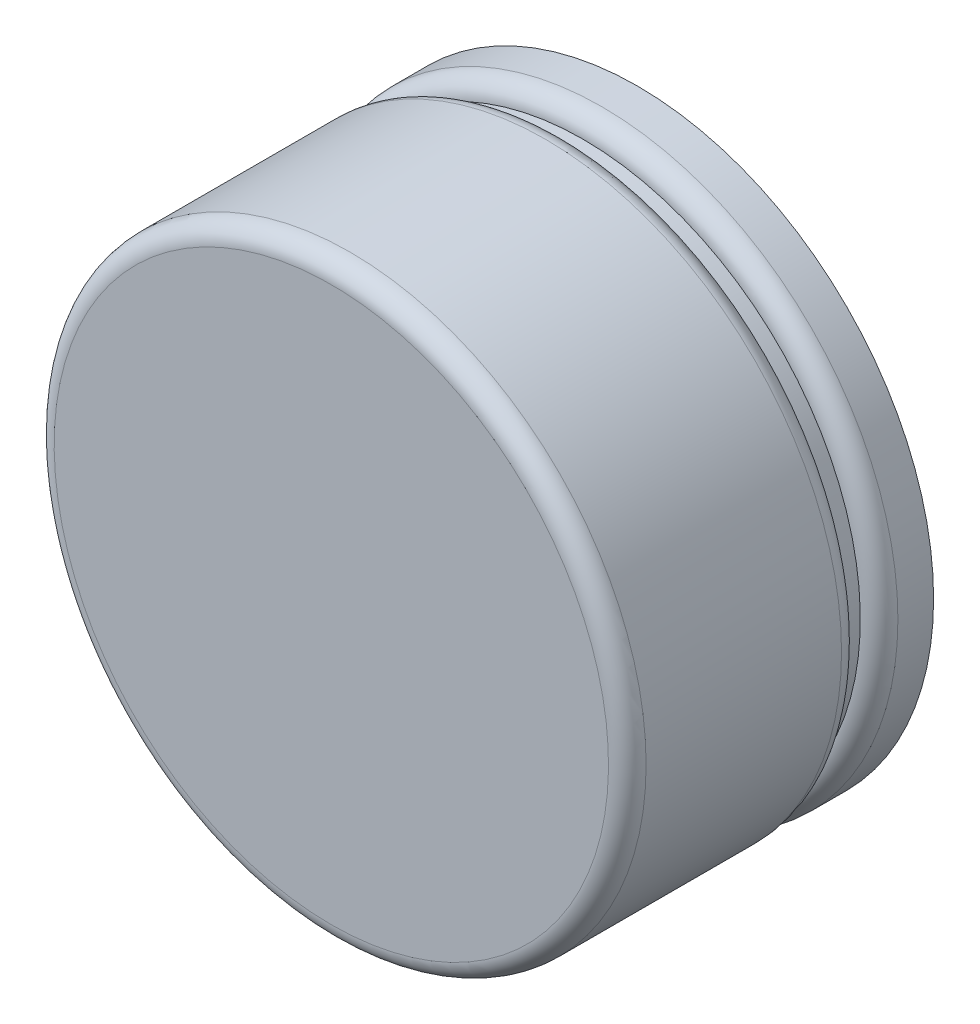
ISO-10303-21;
HEADER;
FILE_DESCRIPTION(('STEP AP214'),'2;1');
FILE_NAME('part.step','',(''),(''),'','','');
FILE_SCHEMA(('AUTOMOTIVE_DESIGN { 1 0 10303 214 1 1 1 1 }'));
ENDSEC;
DATA;
#1=APPLICATION_CONTEXT('core data for automotive mechanical design processes');
#2=APPLICATION_PROTOCOL_DEFINITION('international standard','automotive_design',2000,#1);
#3=PRODUCT_CONTEXT('',#1,'mechanical');
#4=PRODUCT('Part','Part','',(#3));
#5=PRODUCT_RELATED_PRODUCT_CATEGORY('part','',(#4));
#6=PRODUCT_DEFINITION_FORMATION('','',#4);
#7=PRODUCT_DEFINITION_CONTEXT('part definition',#1,'design');
#8=PRODUCT_DEFINITION('design','',#6,#7);
#9=PRODUCT_DEFINITION_SHAPE('','',#8);
#10=(LENGTH_UNIT() NAMED_UNIT(*) SI_UNIT(.MILLI.,.METRE.));
#11=(NAMED_UNIT(*) PLANE_ANGLE_UNIT() SI_UNIT($,.RADIAN.));
#12=(NAMED_UNIT(*) SI_UNIT($,.STERADIAN.) SOLID_ANGLE_UNIT());
#13=UNCERTAINTY_MEASURE_WITH_UNIT(LENGTH_MEASURE(1.E-05),#10,'distance_accuracy_value','');
#14=(GEOMETRIC_REPRESENTATION_CONTEXT(3) GLOBAL_UNCERTAINTY_ASSIGNED_CONTEXT((#13)) GLOBAL_UNIT_ASSIGNED_CONTEXT((#10,
#11,#12)) REPRESENTATION_CONTEXT('',''));
#15=CARTESIAN_POINT('',(0.,0.,0.));
#16=DIRECTION('',(0.,0.,1.));
#17=DIRECTION('',(1.,0.,0.));
#18=AXIS2_PLACEMENT_3D('',#15,#16,#17);
#19=CARTESIAN_POINT('',(-3.62999782,0.94000066,3.89999982));
#20=DIRECTION('',(0.,0.,-1.));
#21=DIRECTION('',(-1.,0.,0.));
#22=AXIS2_PLACEMENT_3D('',#19,#20,#21);
#23=PLANE('',#22);
#24=CARTESIAN_POINT('',(2.54000000069268E-06,-2.81420062,3.89999982));
#25=DIRECTION('',(0.,0.,1.));
#26=DIRECTION('',(0.,-1.,0.));
#27=AXIS2_PLACEMENT_3D('',#24,#25,#26);
#28=CIRCLE('',#27,2.95000000023);
#29=CARTESIAN_POINT('',(2.54000000069268E-06,-5.76420062023,3.89999982));
#30=VERTEX_POINT('',#29);
#31=EDGE_CURVE('E19',#30,#30,#28,.F.);
#32=ORIENTED_EDGE('',*,*,#31,.F.);
#33=EDGE_LOOP('',(#32));
#34=FACE_BOUND('',#33,.T.);
#35=ADVANCED_FACE('F15',(#34),#23,.F.);
#36=CARTESIAN_POINT('',(2.54000000069268E-06,-2.81420062,3.69999982));
#37=DIRECTION('',(0.,0.,1.));
#38=DIRECTION('',(0.,-1.,0.));
#39=AXIS2_PLACEMENT_3D('',#36,#37,#38);
#40=TOROIDAL_SURFACE('',#39,2.95000000023,0.200000000000001);
#41=ORIENTED_EDGE('',*,*,#31,.T.);
#42=EDGE_LOOP('',(#41));
#43=FACE_BOUND('',#42,.T.);
#44=CARTESIAN_POINT('',(2.54000000055E-06,-2.81420062,3.69999982));
#45=DIRECTION('',(0.,0.,-1.));
#46=DIRECTION('',(-1.,0.,0.));
#47=AXIS2_PLACEMENT_3D('',#44,#45,#46);
#48=CIRCLE('',#47,3.15000000023);
#49=CARTESIAN_POINT('',(-3.14999746023,-2.81420062,3.69999982));
#50=VERTEX_POINT('',#49);
#51=EDGE_CURVE('E30',#50,#50,#48,.T.);
#52=ORIENTED_EDGE('',*,*,#51,.F.);
#53=EDGE_LOOP('',(#52));
#54=FACE_BOUND('',#53,.T.);
#55=ADVANCED_FACE('F17',(#43,#54),#40,.T.);
#56=CARTESIAN_POINT('',(2.54000000055E-06,-2.81420062,5.21999996));
#57=DIRECTION('',(0.,0.,-1.));
#58=DIRECTION('',(-1.,0.,0.));
#59=AXIS2_PLACEMENT_3D('',#56,#57,#58);
#60=CYLINDRICAL_SURFACE('',#59,3.15000000023);
#61=CARTESIAN_POINT('',(2.540000000259E-06,-2.81420062,1.61999996));
#62=DIRECTION('',(0.,0.,-1.));
#63=DIRECTION('',(0.,1.,0.));
#64=AXIS2_PLACEMENT_3D('',#61,#62,#63);
#65=CIRCLE('',#64,3.15000000042909);
#66=CARTESIAN_POINT('',(2.540000000259E-06,0.335799380429093,1.61999996));
#67=VERTEX_POINT('',#66);
#68=EDGE_CURVE('E33',#67,#67,#65,.T.);
#69=ORIENTED_EDGE('',*,*,#68,.F.);
#70=EDGE_LOOP('',(#69));
#71=FACE_BOUND('',#70,.T.);
#72=ORIENTED_EDGE('',*,*,#51,.T.);
#73=EDGE_LOOP('',(#72));
#74=FACE_BOUND('',#73,.T.);
#75=ADVANCED_FACE('F48',(#71,#74),#60,.T.);
#76=CARTESIAN_POINT('',(2.540000000259E-06,-2.81420062,1.61999996));
#77=DIRECTION('',(0.,0.,-1.));
#78=DIRECTION('',(0.,1.,0.));
#79=AXIS2_PLACEMENT_3D('',#76,#77,#78);
#80=TOROIDAL_SURFACE('',#79,2.95000000042795,0.200000000001143);
#81=ORIENTED_EDGE('',*,*,#68,.T.);
#82=EDGE_LOOP('',(#81));
#83=FACE_BOUND('',#82,.T.);
#84=CARTESIAN_POINT('',(2.54000000055E-06,-2.81420062,1.41999996));
#85=DIRECTION('',(0.,0.,-1.));
#86=DIRECTION('',(-1.,0.,0.));
#87=AXIS2_PLACEMENT_3D('',#84,#85,#86);
#88=CIRCLE('',#87,2.950000000428);
#89=CARTESIAN_POINT('',(-2.949997460428,-2.81420062,1.41999996));
#90=VERTEX_POINT('',#89);
#91=EDGE_CURVE('E36',#90,#90,#88,.T.);
#92=ORIENTED_EDGE('',*,*,#91,.F.);
#93=EDGE_LOOP('',(#92));
#94=FACE_BOUND('',#93,.T.);
#95=ADVANCED_FACE('F43',(#83,#94),#80,.T.);
#96=CARTESIAN_POINT('',(2.54000000055E-06,-2.81420062,1.41999996));
#97=DIRECTION('',(0.,0.,-1.));
#98=DIRECTION('',(-1.,0.,0.));
#99=AXIS2_PLACEMENT_3D('',#96,#97,#98);
#100=CYLINDRICAL_SURFACE('',#99,2.950000000428);
#101=CARTESIAN_POINT('',(2.54000000025548E-06,-2.81420062,1.21999995999997));
#102=DIRECTION('',(0.,0.,-1.));
#103=DIRECTION('',(0.,1.,0.));
#104=AXIS2_PLACEMENT_3D('',#101,#102,#103);
#105=CIRCLE('',#104,2.95000000042795);
#106=CARTESIAN_POINT('',(2.54000000025548E-06,0.13579938042795,1.21999995999997));
#107=VERTEX_POINT('',#106);
#108=EDGE_CURVE('E27',#107,#107,#105,.T.);
#109=ORIENTED_EDGE('',*,*,#108,.F.);
#110=EDGE_LOOP('',(#109));
#111=FACE_BOUND('',#110,.T.);
#112=ORIENTED_EDGE('',*,*,#91,.T.);
#113=EDGE_LOOP('',(#112));
#114=FACE_BOUND('',#113,.T.);
#115=ADVANCED_FACE('F47',(#111,#114),#100,.T.);
#116=CARTESIAN_POINT('',(2.540000000259E-06,-2.81420062,1.01999996));
#117=DIRECTION('',(0.,0.,-1.));
#118=DIRECTION('',(0.,1.,0.));
#119=AXIS2_PLACEMENT_3D('',#116,#117,#118);
#120=TOROIDAL_SURFACE('',#119,2.95000000042795,0.199999999999965);
#121=ORIENTED_EDGE('',*,*,#108,.T.);
#122=EDGE_LOOP('',(#121));
#123=FACE_BOUND('',#122,.T.);
#124=CARTESIAN_POINT('',(2.54000000055E-06,-2.81420062,1.01999996));
#125=DIRECTION('',(0.,0.,-1.));
#126=DIRECTION('',(-1.,0.,0.));
#127=AXIS2_PLACEMENT_3D('',#124,#125,#126);
#128=CIRCLE('',#127,3.15000000023);
#129=CARTESIAN_POINT('',(-3.14999746023,-2.81420062,1.01999996));
#130=VERTEX_POINT('',#129);
#131=EDGE_CURVE('E23',#130,#130,#128,.T.);
#132=ORIENTED_EDGE('',*,*,#131,.F.);
#133=EDGE_LOOP('',(#132));
#134=FACE_BOUND('',#133,.T.);
#135=ADVANCED_FACE('F68',(#123,#134),#120,.T.);
#136=CARTESIAN_POINT('',(2.54000000055E-06,-2.81420062,1.01999996));
#137=DIRECTION('',(0.,0.,-1.));
#138=DIRECTION('',(-1.,0.,0.));
#139=AXIS2_PLACEMENT_3D('',#136,#137,#138);
#140=CYLINDRICAL_SURFACE('',#139,3.15000000023);
#141=ORIENTED_EDGE('',*,*,#131,.T.);
#142=EDGE_LOOP('',(#141));
#143=FACE_BOUND('',#142,.T.);
#144=CARTESIAN_POINT('',(2.54000000055E-06,-2.81420062,0.64000126));
#145=DIRECTION('',(0.,0.,-1.));
#146=DIRECTION('',(-1.,0.,0.));
#147=AXIS2_PLACEMENT_3D('',#144,#145,#146);
#148=CIRCLE('',#147,3.15000000023);
#149=CARTESIAN_POINT('',(-3.14999746023,-2.81420062,0.64000126));
#150=VERTEX_POINT('',#149);
#151=EDGE_CURVE('E10',#150,#150,#148,.T.);
#152=ORIENTED_EDGE('',*,*,#151,.F.);
#153=EDGE_LOOP('',(#152));
#154=FACE_BOUND('',#153,.T.);
#155=ADVANCED_FACE('F63',(#143,#154),#140,.T.);
#156=CARTESIAN_POINT('',(-4.11999684,1.30999992,0.64000126));
#157=DIRECTION('',(0.,0.,-1.));
#158=DIRECTION('',(-1.,0.,0.));
#159=AXIS2_PLACEMENT_3D('',#156,#157,#158);
#160=PLANE('',#159);
#161=ORIENTED_EDGE('',*,*,#151,.T.);
#162=EDGE_LOOP('',(#161));
#163=FACE_BOUND('',#162,.T.);
#164=ADVANCED_FACE('F61',(#163),#160,.T.);
#165=CLOSED_SHELL('',(#35,#55,#75,#95,#115,#135,#155,#164));
#166=MANIFOLD_SOLID_BREP('B1',#165);
#167=ADVANCED_BREP_SHAPE_REPRESENTATION('',(#18,#166),#14);
#168=SHAPE_DEFINITION_REPRESENTATION(#9,#167);
ENDSEC;
END-ISO-10303-21;
